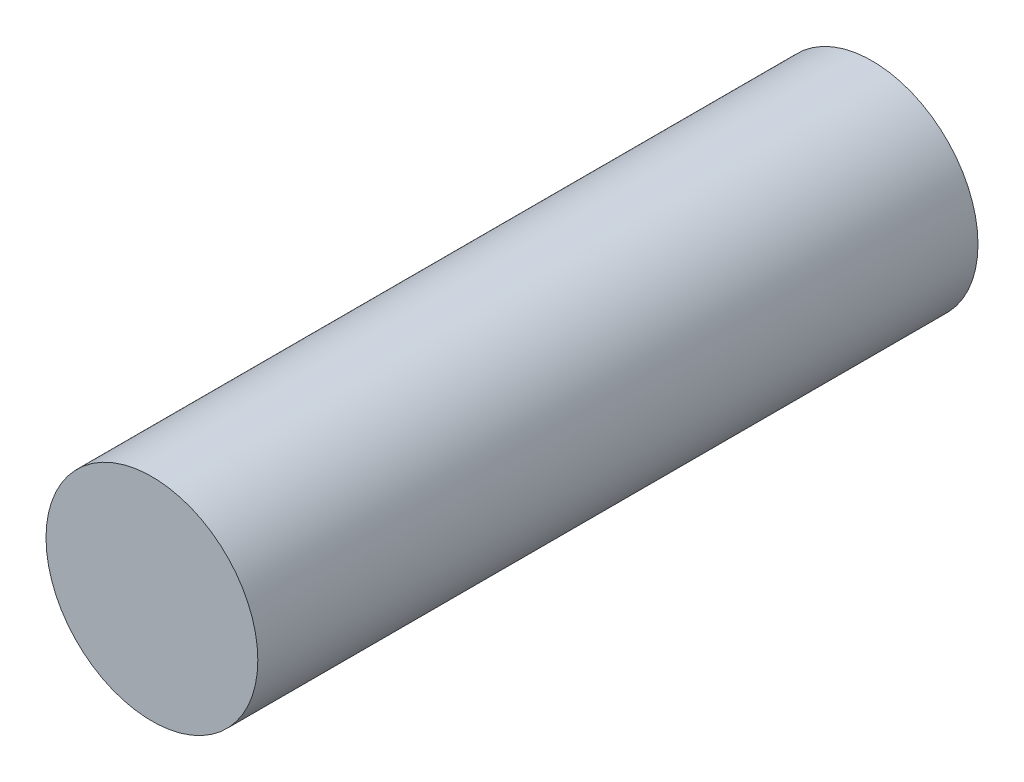
ISO-10303-21;
HEADER;
FILE_DESCRIPTION(('STEP AP214'),'2;1');
FILE_NAME('part.step','',(''),(''),'','','');
FILE_SCHEMA(('AUTOMOTIVE_DESIGN { 1 0 10303 214 1 1 1 1 }'));
ENDSEC;
DATA;
#1=APPLICATION_CONTEXT('core data for automotive mechanical design processes');
#2=APPLICATION_PROTOCOL_DEFINITION('international standard','automotive_design',2000,#1);
#3=PRODUCT_CONTEXT('',#1,'mechanical');
#4=PRODUCT('Part','Part','',(#3));
#5=PRODUCT_RELATED_PRODUCT_CATEGORY('part','',(#4));
#6=PRODUCT_DEFINITION_FORMATION('','',#4);
#7=PRODUCT_DEFINITION_CONTEXT('part definition',#1,'design');
#8=PRODUCT_DEFINITION('design','',#6,#7);
#9=PRODUCT_DEFINITION_SHAPE('','',#8);
#10=(LENGTH_UNIT() NAMED_UNIT(*) SI_UNIT(.MILLI.,.METRE.));
#11=(NAMED_UNIT(*) PLANE_ANGLE_UNIT() SI_UNIT($,.RADIAN.));
#12=(NAMED_UNIT(*) SI_UNIT($,.STERADIAN.) SOLID_ANGLE_UNIT());
#13=UNCERTAINTY_MEASURE_WITH_UNIT(LENGTH_MEASURE(1.E-05),#10,'distance_accuracy_value','');
#14=(GEOMETRIC_REPRESENTATION_CONTEXT(3) GLOBAL_UNCERTAINTY_ASSIGNED_CONTEXT((#13)) GLOBAL_UNIT_ASSIGNED_CONTEXT((#10,
#11,#12)) REPRESENTATION_CONTEXT('',''));
#15=CARTESIAN_POINT('',(0.,0.,0.));
#16=DIRECTION('',(0.,0.,1.));
#17=DIRECTION('',(1.,0.,0.));
#18=AXIS2_PLACEMENT_3D('',#15,#16,#17);
#19=CARTESIAN_POINT('',(0.,0.,17.));
#20=DIRECTION('',(0.,0.,-1.));
#21=DIRECTION('',(-1.,0.,0.));
#22=AXIS2_PLACEMENT_3D('',#19,#20,#21);
#23=CYLINDRICAL_SURFACE('',#22,2.5);
#24=CARTESIAN_POINT('',(0.,0.,17.));
#25=DIRECTION('',(0.,0.,1.));
#26=DIRECTION('',(1.,0.,0.));
#27=AXIS2_PLACEMENT_3D('',#24,#25,#26);
#28=CIRCLE('',#27,2.5);
#29=CARTESIAN_POINT('',(2.5,0.,17.));
#30=VERTEX_POINT('',#29);
#31=EDGE_CURVE('E10',#30,#30,#28,.T.);
#32=ORIENTED_EDGE('',*,*,#31,.F.);
#33=EDGE_LOOP('',(#32));
#34=FACE_BOUND('',#33,.T.);
#35=CARTESIAN_POINT('',(0.,0.,0.));
#36=DIRECTION('',(0.,0.,1.));
#37=DIRECTION('',(1.,0.,0.));
#38=AXIS2_PLACEMENT_3D('',#35,#36,#37);
#39=CIRCLE('',#38,2.5);
#40=CARTESIAN_POINT('',(2.5,0.,0.));
#41=VERTEX_POINT('',#40);
#42=EDGE_CURVE('E35',#41,#41,#39,.T.);
#43=ORIENTED_EDGE('',*,*,#42,.T.);
#44=EDGE_LOOP('',(#43));
#45=FACE_BOUND('',#44,.T.);
#46=ADVANCED_FACE('F32',(#34,#45),#23,.T.);
#47=CARTESIAN_POINT('',(0.,0.,17.));
#48=DIRECTION('',(0.,0.,1.));
#49=DIRECTION('',(1.,0.,0.));
#50=AXIS2_PLACEMENT_3D('',#47,#48,#49);
#51=PLANE('',#50);
#52=ORIENTED_EDGE('',*,*,#31,.T.);
#53=EDGE_LOOP('',(#52));
#54=FACE_BOUND('',#53,.T.);
#55=ADVANCED_FACE('F47',(#54),#51,.T.);
#56=CARTESIAN_POINT('',(0.,0.,0.));
#57=DIRECTION('',(0.,0.,1.));
#58=DIRECTION('',(1.,0.,0.));
#59=AXIS2_PLACEMENT_3D('',#56,#57,#58);
#60=PLANE('',#59);
#61=ORIENTED_EDGE('',*,*,#42,.F.);
#62=EDGE_LOOP('',(#61));
#63=FACE_BOUND('',#62,.T.);
#64=ADVANCED_FACE('F45',(#63),#60,.F.);
#65=CLOSED_SHELL('',(#46,#55,#64));
#66=MANIFOLD_SOLID_BREP('B2',#65);
#67=ADVANCED_BREP_SHAPE_REPRESENTATION('',(#18,#66),#14);
#68=SHAPE_DEFINITION_REPRESENTATION(#9,#67);
ENDSEC;
END-ISO-10303-21;
